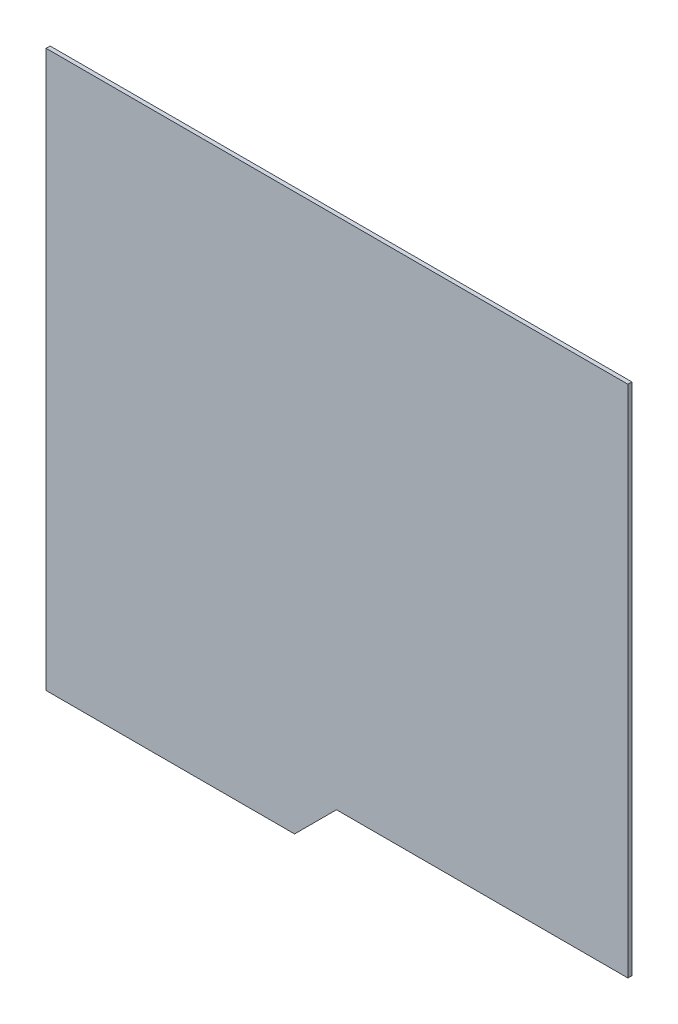
ISO-10303-21;
HEADER;
FILE_DESCRIPTION(('STEP AP214'),'2;1');
FILE_NAME('part.step','',(''),(''),'','','');
FILE_SCHEMA(('AUTOMOTIVE_DESIGN { 1 0 10303 214 1 1 1 1 }'));
ENDSEC;
DATA;
#1=APPLICATION_CONTEXT('core data for automotive mechanical design processes');
#2=APPLICATION_PROTOCOL_DEFINITION('international standard','automotive_design',2000,#1);
#3=PRODUCT_CONTEXT('',#1,'mechanical');
#4=PRODUCT('Part','Part','',(#3));
#5=PRODUCT_RELATED_PRODUCT_CATEGORY('part','',(#4));
#6=PRODUCT_DEFINITION_FORMATION('','',#4);
#7=PRODUCT_DEFINITION_CONTEXT('part definition',#1,'design');
#8=PRODUCT_DEFINITION('design','',#6,#7);
#9=PRODUCT_DEFINITION_SHAPE('','',#8);
#10=(LENGTH_UNIT() NAMED_UNIT(*) SI_UNIT(.MILLI.,.METRE.));
#11=(NAMED_UNIT(*) PLANE_ANGLE_UNIT() SI_UNIT($,.RADIAN.));
#12=(NAMED_UNIT(*) SI_UNIT($,.STERADIAN.) SOLID_ANGLE_UNIT());
#13=UNCERTAINTY_MEASURE_WITH_UNIT(LENGTH_MEASURE(1.E-05),#10,'distance_accuracy_value','');
#14=(GEOMETRIC_REPRESENTATION_CONTEXT(3) GLOBAL_UNCERTAINTY_ASSIGNED_CONTEXT((#13)) GLOBAL_UNIT_ASSIGNED_CONTEXT((#10,
#11,#12)) REPRESENTATION_CONTEXT('',''));
#15=CARTESIAN_POINT('',(0.,0.,0.));
#16=DIRECTION('',(0.,0.,1.));
#17=DIRECTION('',(1.,0.,0.));
#18=AXIS2_PLACEMENT_3D('',#15,#16,#17);
#19=CARTESIAN_POINT('',(7.2263,-5.8674,0.0999998));
#20=DIRECTION('',(0.,0.,-1.));
#21=DIRECTION('',(0.,-1.,0.));
#22=AXIS2_PLACEMENT_3D('',#19,#20,#21);
#23=PLANE('',#22);
#24=DIRECTION('',(0.,1.,0.));
#25=VECTOR('',#24,1.);
#26=CARTESIAN_POINT('',(7.2263,-5.8674,0.0999998));
#27=LINE('',#26,#25);
#28=CARTESIAN_POINT('',(7.2263,-5.8674,0.0999998));
#29=VERTEX_POINT('',#28);
#30=CARTESIAN_POINT('',(7.2263,6.9088,0.0999998));
#31=VERTEX_POINT('',#30);
#32=EDGE_CURVE('E97',#29,#31,#27,.T.);
#33=ORIENTED_EDGE('',*,*,#32,.T.);
#34=DIRECTION('',(-1.,0.,0.));
#35=VECTOR('',#34,1.);
#36=CARTESIAN_POINT('',(7.2263,6.9088,0.0999998));
#37=LINE('',#36,#35);
#38=CARTESIAN_POINT('',(-7.2263,6.9088,0.0999998));
#39=VERTEX_POINT('',#38);
#40=EDGE_CURVE('E103',#31,#39,#37,.T.);
#41=ORIENTED_EDGE('',*,*,#40,.T.);
#42=DIRECTION('',(0.,-1.,0.));
#43=VECTOR('',#42,1.);
#44=CARTESIAN_POINT('',(-7.2263,6.9088,0.0999998));
#45=LINE('',#44,#43);
#46=CARTESIAN_POINT('',(-7.2263,-6.9088,0.0999998));
#47=VERTEX_POINT('',#46);
#48=EDGE_CURVE('E135',#39,#47,#45,.T.);
#49=ORIENTED_EDGE('',*,*,#48,.T.);
#50=DIRECTION('',(1.,0.,0.));
#51=VECTOR('',#50,1.);
#52=CARTESIAN_POINT('',(-7.2263,-6.9088,0.0999998));
#53=LINE('',#52,#51);
#54=CARTESIAN_POINT('',(-1.0541,-6.9088,0.0999998));
#55=VERTEX_POINT('',#54);
#56=EDGE_CURVE('E124',#47,#55,#53,.T.);
#57=ORIENTED_EDGE('',*,*,#56,.T.);
#58=DIRECTION('',(0.707106781186548,0.707106781186548,0.));
#59=VECTOR('',#58,1.);
#60=CARTESIAN_POINT('',(-1.0541,-6.9088,0.0999998));
#61=LINE('',#60,#59);
#62=CARTESIAN_POINT('',(-0.0127,-5.8674,0.0999998));
#63=VERTEX_POINT('',#62);
#64=EDGE_CURVE('E146',#55,#63,#61,.T.);
#65=ORIENTED_EDGE('',*,*,#64,.T.);
#66=DIRECTION('',(1.,0.,0.));
#67=VECTOR('',#66,1.);
#68=CARTESIAN_POINT('',(-0.0127,-5.8674,0.0999998));
#69=LINE('',#68,#67);
#70=EDGE_CURVE('E11',#63,#29,#69,.T.);
#71=ORIENTED_EDGE('',*,*,#70,.T.);
#72=EDGE_LOOP('',(#33,#41,#49,#57,#65,#71));
#73=FACE_BOUND('',#72,.T.);
#74=ADVANCED_FACE('F17',(#73),#23,.F.);
#75=CARTESIAN_POINT('',(7.2263,-5.8674,0.));
#76=DIRECTION('',(0.,0.,-1.));
#77=DIRECTION('',(0.,-1.,0.));
#78=AXIS2_PLACEMENT_3D('',#75,#76,#77);
#79=PLANE('',#78);
#80=DIRECTION('',(0.,1.,0.));
#81=VECTOR('',#80,1.);
#82=CARTESIAN_POINT('',(7.2263,-5.8674,0.));
#83=LINE('',#82,#81);
#84=CARTESIAN_POINT('',(7.2263,-5.8674,0.));
#85=VERTEX_POINT('',#84);
#86=CARTESIAN_POINT('',(7.2263,6.9088,0.));
#87=VERTEX_POINT('',#86);
#88=EDGE_CURVE('E89',#85,#87,#83,.T.);
#89=ORIENTED_EDGE('',*,*,#88,.F.);
#90=DIRECTION('',(1.,0.,0.));
#91=VECTOR('',#90,1.);
#92=CARTESIAN_POINT('',(-0.0127,-5.8674,0.));
#93=LINE('',#92,#91);
#94=CARTESIAN_POINT('',(-0.0127,-5.8674,0.));
#95=VERTEX_POINT('',#94);
#96=EDGE_CURVE('E27',#95,#85,#93,.T.);
#97=ORIENTED_EDGE('',*,*,#96,.F.);
#98=DIRECTION('',(0.707106781186548,0.707106781186548,0.));
#99=VECTOR('',#98,1.);
#100=CARTESIAN_POINT('',(-1.0541,-6.9088,0.));
#101=LINE('',#100,#99);
#102=CARTESIAN_POINT('',(-1.0541,-6.9088,0.));
#103=VERTEX_POINT('',#102);
#104=EDGE_CURVE('E128',#103,#95,#101,.T.);
#105=ORIENTED_EDGE('',*,*,#104,.F.);
#106=DIRECTION('',(1.,0.,0.));
#107=VECTOR('',#106,1.);
#108=CARTESIAN_POINT('',(-7.2263,-6.9088,0.));
#109=LINE('',#108,#107);
#110=CARTESIAN_POINT('',(-7.2263,-6.9088,0.));
#111=VERTEX_POINT('',#110);
#112=EDGE_CURVE('E131',#111,#103,#109,.T.);
#113=ORIENTED_EDGE('',*,*,#112,.F.);
#114=DIRECTION('',(0.,-1.,0.));
#115=VECTOR('',#114,1.);
#116=CARTESIAN_POINT('',(-7.2263,6.9088,0.));
#117=LINE('',#116,#115);
#118=CARTESIAN_POINT('',(-7.2263,6.9088,0.));
#119=VERTEX_POINT('',#118);
#120=EDGE_CURVE('E92',#119,#111,#117,.T.);
#121=ORIENTED_EDGE('',*,*,#120,.F.);
#122=DIRECTION('',(-1.,0.,0.));
#123=VECTOR('',#122,1.);
#124=CARTESIAN_POINT('',(7.2263,6.9088,0.));
#125=LINE('',#124,#123);
#126=EDGE_CURVE('E85',#87,#119,#125,.T.);
#127=ORIENTED_EDGE('',*,*,#126,.F.);
#128=EDGE_LOOP('',(#89,#97,#105,#113,#121,#127));
#129=FACE_BOUND('',#128,.T.);
#130=ADVANCED_FACE('F87',(#129),#79,.T.);
#131=CARTESIAN_POINT('',(-0.0127,-5.8674,0.));
#132=DIRECTION('',(0.,1.,0.));
#133=DIRECTION('',(1.,0.,0.));
#134=AXIS2_PLACEMENT_3D('',#131,#132,#133);
#135=PLANE('',#134);
#136=DIRECTION('',(0.,0.,1.));
#137=VECTOR('',#136,1.);
#138=CARTESIAN_POINT('',(-0.0127,-5.8674,0.));
#139=LINE('',#138,#137);
#140=EDGE_CURVE('E142',#95,#63,#139,.T.);
#141=ORIENTED_EDGE('',*,*,#140,.F.);
#142=ORIENTED_EDGE('',*,*,#96,.T.);
#143=DIRECTION('',(0.,0.,1.));
#144=VECTOR('',#143,1.);
#145=CARTESIAN_POINT('',(7.2263,-5.8674,0.));
#146=LINE('',#145,#144);
#147=EDGE_CURVE('E110',#85,#29,#146,.T.);
#148=ORIENTED_EDGE('',*,*,#147,.T.);
#149=ORIENTED_EDGE('',*,*,#70,.F.);
#150=EDGE_LOOP('',(#141,#142,#148,#149));
#151=FACE_BOUND('',#150,.T.);
#152=ADVANCED_FACE('F19',(#151),#135,.F.);
#153=CARTESIAN_POINT('',(-1.0541,-6.9088,0.));
#154=DIRECTION('',(-0.707106781186548,0.707106781186548,0.));
#155=DIRECTION('',(0.,0.,1.));
#156=AXIS2_PLACEMENT_3D('',#153,#154,#155);
#157=PLANE('',#156);
#158=DIRECTION('',(0.,0.,1.));
#159=VECTOR('',#158,1.);
#160=CARTESIAN_POINT('',(-1.0541,-6.9088,0.));
#161=LINE('',#160,#159);
#162=EDGE_CURVE('E120',#103,#55,#161,.T.);
#163=ORIENTED_EDGE('',*,*,#162,.F.);
#164=ORIENTED_EDGE('',*,*,#104,.T.);
#165=ORIENTED_EDGE('',*,*,#140,.T.);
#166=ORIENTED_EDGE('',*,*,#64,.F.);
#167=EDGE_LOOP('',(#163,#164,#165,#166));
#168=FACE_BOUND('',#167,.T.);
#169=ADVANCED_FACE('F223',(#168),#157,.F.);
#170=CARTESIAN_POINT('',(-7.2263,-6.9088,0.));
#171=DIRECTION('',(0.,1.,0.));
#172=DIRECTION('',(1.,0.,0.));
#173=AXIS2_PLACEMENT_3D('',#170,#171,#172);
#174=PLANE('',#173);
#175=DIRECTION('',(0.,0.,1.));
#176=VECTOR('',#175,1.);
#177=CARTESIAN_POINT('',(-7.2263,-6.9088,0.));
#178=LINE('',#177,#176);
#179=EDGE_CURVE('E123',#111,#47,#178,.T.);
#180=ORIENTED_EDGE('',*,*,#179,.F.);
#181=ORIENTED_EDGE('',*,*,#112,.T.);
#182=ORIENTED_EDGE('',*,*,#162,.T.);
#183=ORIENTED_EDGE('',*,*,#56,.F.);
#184=EDGE_LOOP('',(#180,#181,#182,#183));
#185=FACE_BOUND('',#184,.T.);
#186=ADVANCED_FACE('F161',(#185),#174,.F.);
#187=CARTESIAN_POINT('',(-7.2263,6.9088,0.));
#188=DIRECTION('',(1.,0.,0.));
#189=DIRECTION('',(0.,1.,0.));
#190=AXIS2_PLACEMENT_3D('',#187,#188,#189);
#191=PLANE('',#190);
#192=DIRECTION('',(0.,0.,1.));
#193=VECTOR('',#192,1.);
#194=CARTESIAN_POINT('',(-7.2263,6.9088,0.));
#195=LINE('',#194,#193);
#196=EDGE_CURVE('E21',#119,#39,#195,.T.);
#197=ORIENTED_EDGE('',*,*,#196,.F.);
#198=ORIENTED_EDGE('',*,*,#120,.T.);
#199=ORIENTED_EDGE('',*,*,#179,.T.);
#200=ORIENTED_EDGE('',*,*,#48,.F.);
#201=EDGE_LOOP('',(#197,#198,#199,#200));
#202=FACE_BOUND('',#201,.T.);
#203=ADVANCED_FACE('F159',(#202),#191,.F.);
#204=CARTESIAN_POINT('',(7.2263,6.9088,0.));
#205=DIRECTION('',(0.,-1.,0.));
#206=DIRECTION('',(0.,0.,-1.));
#207=AXIS2_PLACEMENT_3D('',#204,#205,#206);
#208=PLANE('',#207);
#209=DIRECTION('',(0.,0.,1.));
#210=VECTOR('',#209,1.);
#211=CARTESIAN_POINT('',(7.2263,6.9088,0.));
#212=LINE('',#211,#210);
#213=EDGE_CURVE('E100',#87,#31,#212,.T.);
#214=ORIENTED_EDGE('',*,*,#213,.F.);
#215=ORIENTED_EDGE('',*,*,#126,.T.);
#216=ORIENTED_EDGE('',*,*,#196,.T.);
#217=ORIENTED_EDGE('',*,*,#40,.F.);
#218=EDGE_LOOP('',(#214,#215,#216,#217));
#219=FACE_BOUND('',#218,.T.);
#220=ADVANCED_FACE('F101',(#219),#208,.F.);
#221=CARTESIAN_POINT('',(7.2263,-5.8674,0.));
#222=DIRECTION('',(-1.,0.,0.));
#223=DIRECTION('',(0.,0.,1.));
#224=AXIS2_PLACEMENT_3D('',#221,#222,#223);
#225=PLANE('',#224);
#226=ORIENTED_EDGE('',*,*,#147,.F.);
#227=ORIENTED_EDGE('',*,*,#88,.T.);
#228=ORIENTED_EDGE('',*,*,#213,.T.);
#229=ORIENTED_EDGE('',*,*,#32,.F.);
#230=EDGE_LOOP('',(#226,#227,#228,#229));
#231=FACE_BOUND('',#230,.T.);
#232=ADVANCED_FACE('F109',(#231),#225,.F.);
#233=CLOSED_SHELL('',(#74,#130,#152,#169,#186,#203,#220,#232));
#234=MANIFOLD_SOLID_BREP('B1',#233);
#235=ADVANCED_BREP_SHAPE_REPRESENTATION('',(#18,#234),#14);
#236=SHAPE_DEFINITION_REPRESENTATION(#9,#235);
ENDSEC;
END-ISO-10303-21;
